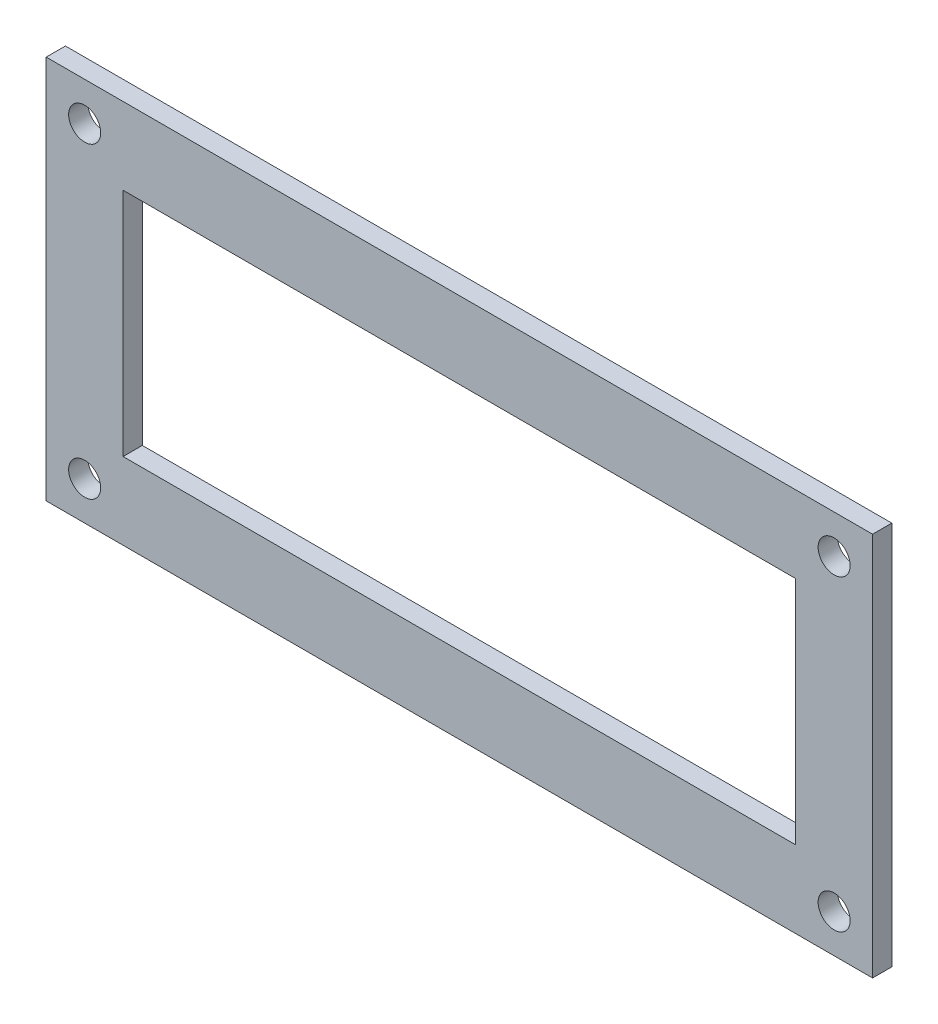
ISO-10303-21;
HEADER;
FILE_DESCRIPTION(('STEP AP214'),'2;1');
FILE_NAME('part.step','',(''),(''),'','','');
FILE_SCHEMA(('AUTOMOTIVE_DESIGN { 1 0 10303 214 1 1 1 1 }'));
ENDSEC;
DATA;
#1=APPLICATION_CONTEXT('core data for automotive mechanical design processes');
#2=APPLICATION_PROTOCOL_DEFINITION('international standard','automotive_design',2000,#1);
#3=PRODUCT_CONTEXT('',#1,'mechanical');
#4=PRODUCT('Part','Part','',(#3));
#5=PRODUCT_RELATED_PRODUCT_CATEGORY('part','',(#4));
#6=PRODUCT_DEFINITION_FORMATION('','',#4);
#7=PRODUCT_DEFINITION_CONTEXT('part definition',#1,'design');
#8=PRODUCT_DEFINITION('design','',#6,#7);
#9=PRODUCT_DEFINITION_SHAPE('','',#8);
#10=(LENGTH_UNIT() NAMED_UNIT(*) SI_UNIT(.MILLI.,.METRE.));
#11=(NAMED_UNIT(*) PLANE_ANGLE_UNIT() SI_UNIT($,.RADIAN.));
#12=(NAMED_UNIT(*) SI_UNIT($,.STERADIAN.) SOLID_ANGLE_UNIT());
#13=UNCERTAINTY_MEASURE_WITH_UNIT(LENGTH_MEASURE(1.E-05),#10,'distance_accuracy_value','');
#14=(GEOMETRIC_REPRESENTATION_CONTEXT(3) GLOBAL_UNCERTAINTY_ASSIGNED_CONTEXT((#13)) GLOBAL_UNIT_ASSIGNED_CONTEXT((#10,
#11,#12)) REPRESENTATION_CONTEXT('',''));
#15=CARTESIAN_POINT('',(0.,0.,0.));
#16=DIRECTION('',(0.,0.,1.));
#17=DIRECTION('',(1.,0.,0.));
#18=AXIS2_PLACEMENT_3D('',#15,#16,#17);
#19=CARTESIAN_POINT('',(0.,0.,3.));
#20=DIRECTION('',(0.,0.,-1.));
#21=DIRECTION('',(-1.,0.,0.));
#22=AXIS2_PLACEMENT_3D('',#19,#20,#21);
#23=PLANE('',#22);
#24=CARTESIAN_POINT('',(123.,6.,3.));
#25=DIRECTION('',(0.,0.,1.));
#26=DIRECTION('',(1.,0.,0.));
#27=AXIS2_PLACEMENT_3D('',#24,#25,#26);
#28=CIRCLE('',#27,2.5);
#29=CARTESIAN_POINT('',(125.5,6.,3.));
#30=VERTEX_POINT('',#29);
#31=EDGE_CURVE('E134',#30,#30,#28,.T.);
#32=ORIENTED_EDGE('',*,*,#31,.F.);
#33=EDGE_LOOP('',(#32));
#34=FACE_BOUND('',#33,.T.);
#35=CARTESIAN_POINT('',(6.,54.,3.));
#36=DIRECTION('',(0.,0.,1.));
#37=DIRECTION('',(1.,0.,0.));
#38=AXIS2_PLACEMENT_3D('',#35,#36,#37);
#39=CIRCLE('',#38,2.5);
#40=CARTESIAN_POINT('',(8.5,54.,3.));
#41=VERTEX_POINT('',#40);
#42=EDGE_CURVE('E146',#41,#41,#39,.T.);
#43=ORIENTED_EDGE('',*,*,#42,.F.);
#44=EDGE_LOOP('',(#43));
#45=FACE_BOUND('',#44,.T.);
#46=DIRECTION('',(0.,-1.,0.));
#47=VECTOR('',#46,1.);
#48=CARTESIAN_POINT('',(0.,0.,3.));
#49=LINE('',#48,#47);
#50=CARTESIAN_POINT('',(0.,60.,3.));
#51=VERTEX_POINT('',#50);
#52=CARTESIAN_POINT('',(0.,0.,3.));
#53=VERTEX_POINT('',#52);
#54=EDGE_CURVE('E158',#51,#53,#49,.T.);
#55=ORIENTED_EDGE('',*,*,#54,.T.);
#56=DIRECTION('',(1.,0.,0.));
#57=VECTOR('',#56,1.);
#58=CARTESIAN_POINT('',(0.,0.,3.));
#59=LINE('',#58,#57);
#60=CARTESIAN_POINT('',(129.,0.,3.));
#61=VERTEX_POINT('',#60);
#62=EDGE_CURVE('E161',#53,#61,#59,.T.);
#63=ORIENTED_EDGE('',*,*,#62,.T.);
#64=DIRECTION('',(0.,1.,0.));
#65=VECTOR('',#64,1.);
#66=CARTESIAN_POINT('',(129.,0.,3.));
#67=LINE('',#66,#65);
#68=CARTESIAN_POINT('',(129.,60.,3.));
#69=VERTEX_POINT('',#68);
#70=EDGE_CURVE('E164',#61,#69,#67,.T.);
#71=ORIENTED_EDGE('',*,*,#70,.T.);
#72=DIRECTION('',(-1.,0.,0.));
#73=VECTOR('',#72,1.);
#74=CARTESIAN_POINT('',(0.,60.,3.));
#75=LINE('',#74,#73);
#76=EDGE_CURVE('E166',#69,#51,#75,.T.);
#77=ORIENTED_EDGE('',*,*,#76,.T.);
#78=EDGE_LOOP('',(#55,#63,#71,#77));
#79=FACE_BOUND('',#78,.T.);
#80=CARTESIAN_POINT('',(6.,6.,3.));
#81=DIRECTION('',(0.,0.,1.));
#82=DIRECTION('',(1.,0.,0.));
#83=AXIS2_PLACEMENT_3D('',#80,#81,#82);
#84=CIRCLE('',#83,2.5);
#85=CARTESIAN_POINT('',(8.5,6.,3.));
#86=VERTEX_POINT('',#85);
#87=EDGE_CURVE('E152',#86,#86,#84,.T.);
#88=ORIENTED_EDGE('',*,*,#87,.F.);
#89=EDGE_LOOP('',(#88));
#90=FACE_BOUND('',#89,.T.);
#91=CARTESIAN_POINT('',(123.,54.,3.));
#92=DIRECTION('',(0.,0.,1.));
#93=DIRECTION('',(1.,0.,0.));
#94=AXIS2_PLACEMENT_3D('',#91,#92,#93);
#95=CIRCLE('',#94,2.5);
#96=CARTESIAN_POINT('',(125.5,54.,3.));
#97=VERTEX_POINT('',#96);
#98=EDGE_CURVE('E140',#97,#97,#95,.T.);
#99=ORIENTED_EDGE('',*,*,#98,.F.);
#100=EDGE_LOOP('',(#99));
#101=FACE_BOUND('',#100,.T.);
#102=DIRECTION('',(0.,-1.,0.));
#103=VECTOR('',#102,1.);
#104=CARTESIAN_POINT('',(12.,48.,3.));
#105=LINE('',#104,#103);
#106=CARTESIAN_POINT('',(12.,48.,3.));
#107=VERTEX_POINT('',#106);
#108=CARTESIAN_POINT('',(12.,12.,3.));
#109=VERTEX_POINT('',#108);
#110=EDGE_CURVE('E98',#107,#109,#105,.T.);
#111=ORIENTED_EDGE('',*,*,#110,.F.);
#112=DIRECTION('',(-1.,0.,0.));
#113=VECTOR('',#112,1.);
#114=CARTESIAN_POINT('',(12.,48.,3.));
#115=LINE('',#114,#113);
#116=CARTESIAN_POINT('',(117.,48.,3.));
#117=VERTEX_POINT('',#116);
#118=EDGE_CURVE('E120',#117,#107,#115,.T.);
#119=ORIENTED_EDGE('',*,*,#118,.F.);
#120=DIRECTION('',(0.,1.,0.));
#121=VECTOR('',#120,1.);
#122=CARTESIAN_POINT('',(117.,48.,3.));
#123=LINE('',#122,#121);
#124=CARTESIAN_POINT('',(117.,12.,3.));
#125=VERTEX_POINT('',#124);
#126=EDGE_CURVE('E118',#125,#117,#123,.T.);
#127=ORIENTED_EDGE('',*,*,#126,.F.);
#128=DIRECTION('',(1.,0.,0.));
#129=VECTOR('',#128,1.);
#130=CARTESIAN_POINT('',(12.,12.,3.));
#131=LINE('',#130,#129);
#132=EDGE_CURVE('E106',#109,#125,#131,.T.);
#133=ORIENTED_EDGE('',*,*,#132,.F.);
#134=EDGE_LOOP('',(#111,#119,#127,#133));
#135=FACE_BOUND('',#134,.T.);
#136=ADVANCED_FACE('F33',(#34,#45,#79,#90,#101,#135),#23,.F.);
#137=CARTESIAN_POINT('',(0.,0.,0.));
#138=DIRECTION('',(0.,0.,-1.));
#139=DIRECTION('',(-1.,0.,0.));
#140=AXIS2_PLACEMENT_3D('',#137,#138,#139);
#141=PLANE('',#140);
#142=CARTESIAN_POINT('',(123.,6.,0.));
#143=DIRECTION('',(0.,0.,1.));
#144=DIRECTION('',(1.,0.,0.));
#145=AXIS2_PLACEMENT_3D('',#142,#143,#144);
#146=CIRCLE('',#145,2.5);
#147=CARTESIAN_POINT('',(125.5,6.,0.));
#148=VERTEX_POINT('',#147);
#149=EDGE_CURVE('E114',#148,#148,#146,.T.);
#150=ORIENTED_EDGE('',*,*,#149,.T.);
#151=EDGE_LOOP('',(#150));
#152=FACE_BOUND('',#151,.T.);
#153=CARTESIAN_POINT('',(6.,54.,0.));
#154=DIRECTION('',(0.,0.,1.));
#155=DIRECTION('',(1.,0.,0.));
#156=AXIS2_PLACEMENT_3D('',#153,#154,#155);
#157=CIRCLE('',#156,2.5);
#158=CARTESIAN_POINT('',(8.5,54.,0.));
#159=VERTEX_POINT('',#158);
#160=EDGE_CURVE('E143',#159,#159,#157,.T.);
#161=ORIENTED_EDGE('',*,*,#160,.T.);
#162=EDGE_LOOP('',(#161));
#163=FACE_BOUND('',#162,.T.);
#164=DIRECTION('',(0.,-1.,0.));
#165=VECTOR('',#164,1.);
#166=CARTESIAN_POINT('',(0.,0.,0.));
#167=LINE('',#166,#165);
#168=CARTESIAN_POINT('',(0.,60.,0.));
#169=VERTEX_POINT('',#168);
#170=CARTESIAN_POINT('',(0.,0.,0.));
#171=VERTEX_POINT('',#170);
#172=EDGE_CURVE('E155',#169,#171,#167,.T.);
#173=ORIENTED_EDGE('',*,*,#172,.F.);
#174=DIRECTION('',(-1.,0.,0.));
#175=VECTOR('',#174,1.);
#176=CARTESIAN_POINT('',(0.,60.,0.));
#177=LINE('',#176,#175);
#178=CARTESIAN_POINT('',(129.,60.,0.));
#179=VERTEX_POINT('',#178);
#180=EDGE_CURVE('E162',#179,#169,#177,.T.);
#181=ORIENTED_EDGE('',*,*,#180,.F.);
#182=DIRECTION('',(0.,1.,0.));
#183=VECTOR('',#182,1.);
#184=CARTESIAN_POINT('',(129.,0.,0.));
#185=LINE('',#184,#183);
#186=CARTESIAN_POINT('',(129.,0.,0.));
#187=VERTEX_POINT('',#186);
#188=EDGE_CURVE('E173',#187,#179,#185,.T.);
#189=ORIENTED_EDGE('',*,*,#188,.F.);
#190=DIRECTION('',(1.,0.,0.));
#191=VECTOR('',#190,1.);
#192=CARTESIAN_POINT('',(0.,0.,0.));
#193=LINE('',#192,#191);
#194=EDGE_CURVE('E171',#171,#187,#193,.T.);
#195=ORIENTED_EDGE('',*,*,#194,.F.);
#196=EDGE_LOOP('',(#173,#181,#189,#195));
#197=FACE_BOUND('',#196,.T.);
#198=CARTESIAN_POINT('',(6.,6.,0.));
#199=DIRECTION('',(0.,0.,1.));
#200=DIRECTION('',(1.,0.,0.));
#201=AXIS2_PLACEMENT_3D('',#198,#199,#200);
#202=CIRCLE('',#201,2.5);
#203=CARTESIAN_POINT('',(8.5,6.,0.));
#204=VERTEX_POINT('',#203);
#205=EDGE_CURVE('E149',#204,#204,#202,.T.);
#206=ORIENTED_EDGE('',*,*,#205,.T.);
#207=EDGE_LOOP('',(#206));
#208=FACE_BOUND('',#207,.T.);
#209=CARTESIAN_POINT('',(123.,54.,0.));
#210=DIRECTION('',(0.,0.,1.));
#211=DIRECTION('',(1.,0.,0.));
#212=AXIS2_PLACEMENT_3D('',#209,#210,#211);
#213=CIRCLE('',#212,2.5);
#214=CARTESIAN_POINT('',(125.5,54.,0.));
#215=VERTEX_POINT('',#214);
#216=EDGE_CURVE('E137',#215,#215,#213,.T.);
#217=ORIENTED_EDGE('',*,*,#216,.T.);
#218=EDGE_LOOP('',(#217));
#219=FACE_BOUND('',#218,.T.);
#220=DIRECTION('',(-1.,0.,0.));
#221=VECTOR('',#220,1.);
#222=CARTESIAN_POINT('',(12.,48.,0.));
#223=LINE('',#222,#221);
#224=CARTESIAN_POINT('',(117.,48.,0.));
#225=VERTEX_POINT('',#224);
#226=CARTESIAN_POINT('',(12.,48.,0.));
#227=VERTEX_POINT('',#226);
#228=EDGE_CURVE('E107',#225,#227,#223,.T.);
#229=ORIENTED_EDGE('',*,*,#228,.T.);
#230=DIRECTION('',(0.,-1.,0.));
#231=VECTOR('',#230,1.);
#232=CARTESIAN_POINT('',(12.,48.,0.));
#233=LINE('',#232,#231);
#234=CARTESIAN_POINT('',(12.,12.,0.));
#235=VERTEX_POINT('',#234);
#236=EDGE_CURVE('E56',#227,#235,#233,.T.);
#237=ORIENTED_EDGE('',*,*,#236,.T.);
#238=DIRECTION('',(1.,0.,0.));
#239=VECTOR('',#238,1.);
#240=CARTESIAN_POINT('',(12.,12.,0.));
#241=LINE('',#240,#239);
#242=CARTESIAN_POINT('',(117.,12.,0.));
#243=VERTEX_POINT('',#242);
#244=EDGE_CURVE('E113',#235,#243,#241,.T.);
#245=ORIENTED_EDGE('',*,*,#244,.T.);
#246=DIRECTION('',(0.,1.,0.));
#247=VECTOR('',#246,1.);
#248=CARTESIAN_POINT('',(117.,48.,0.));
#249=LINE('',#248,#247);
#250=EDGE_CURVE('E126',#243,#225,#249,.T.);
#251=ORIENTED_EDGE('',*,*,#250,.T.);
#252=EDGE_LOOP('',(#229,#237,#245,#251));
#253=FACE_BOUND('',#252,.T.);
#254=ADVANCED_FACE('F191',(#152,#163,#197,#208,#219,#253),#141,.T.);
#255=CARTESIAN_POINT('',(0.,0.,3.));
#256=DIRECTION('',(1.,0.,0.));
#257=DIRECTION('',(0.,0.,-1.));
#258=AXIS2_PLACEMENT_3D('',#255,#256,#257);
#259=PLANE('',#258);
#260=ORIENTED_EDGE('',*,*,#172,.T.);
#261=DIRECTION('',(0.,0.,-1.));
#262=VECTOR('',#261,1.);
#263=CARTESIAN_POINT('',(0.,0.,3.));
#264=LINE('',#263,#262);
#265=EDGE_CURVE('E11',#53,#171,#264,.T.);
#266=ORIENTED_EDGE('',*,*,#265,.F.);
#267=ORIENTED_EDGE('',*,*,#54,.F.);
#268=DIRECTION('',(0.,0.,-1.));
#269=VECTOR('',#268,1.);
#270=CARTESIAN_POINT('',(0.,60.,3.));
#271=LINE('',#270,#269);
#272=EDGE_CURVE('E168',#51,#169,#271,.T.);
#273=ORIENTED_EDGE('',*,*,#272,.T.);
#274=EDGE_LOOP('',(#260,#266,#267,#273));
#275=FACE_BOUND('',#274,.T.);
#276=ADVANCED_FACE('F35',(#275),#259,.F.);
#277=CARTESIAN_POINT('',(0.,0.,3.));
#278=DIRECTION('',(0.,1.,0.));
#279=DIRECTION('',(0.,0.,1.));
#280=AXIS2_PLACEMENT_3D('',#277,#278,#279);
#281=PLANE('',#280);
#282=ORIENTED_EDGE('',*,*,#194,.T.);
#283=DIRECTION('',(0.,0.,-1.));
#284=VECTOR('',#283,1.);
#285=CARTESIAN_POINT('',(129.,0.,3.));
#286=LINE('',#285,#284);
#287=EDGE_CURVE('E41',#61,#187,#286,.T.);
#288=ORIENTED_EDGE('',*,*,#287,.F.);
#289=ORIENTED_EDGE('',*,*,#62,.F.);
#290=ORIENTED_EDGE('',*,*,#265,.T.);
#291=EDGE_LOOP('',(#282,#288,#289,#290));
#292=FACE_BOUND('',#291,.T.);
#293=ADVANCED_FACE('F202',(#292),#281,.F.);
#294=CARTESIAN_POINT('',(129.,0.,3.));
#295=DIRECTION('',(-1.,0.,0.));
#296=DIRECTION('',(0.,0.,1.));
#297=AXIS2_PLACEMENT_3D('',#294,#295,#296);
#298=PLANE('',#297);
#299=ORIENTED_EDGE('',*,*,#188,.T.);
#300=DIRECTION('',(0.,0.,-1.));
#301=VECTOR('',#300,1.);
#302=CARTESIAN_POINT('',(129.,60.,3.));
#303=LINE('',#302,#301);
#304=EDGE_CURVE('E178',#69,#179,#303,.T.);
#305=ORIENTED_EDGE('',*,*,#304,.F.);
#306=ORIENTED_EDGE('',*,*,#70,.F.);
#307=ORIENTED_EDGE('',*,*,#287,.T.);
#308=EDGE_LOOP('',(#299,#305,#306,#307));
#309=FACE_BOUND('',#308,.T.);
#310=ADVANCED_FACE('F185',(#309),#298,.F.);
#311=CARTESIAN_POINT('',(0.,60.,3.));
#312=DIRECTION('',(0.,-1.,0.));
#313=DIRECTION('',(0.,0.,-1.));
#314=AXIS2_PLACEMENT_3D('',#311,#312,#313);
#315=PLANE('',#314);
#316=ORIENTED_EDGE('',*,*,#180,.T.);
#317=ORIENTED_EDGE('',*,*,#272,.F.);
#318=ORIENTED_EDGE('',*,*,#76,.F.);
#319=ORIENTED_EDGE('',*,*,#304,.T.);
#320=EDGE_LOOP('',(#316,#317,#318,#319));
#321=FACE_BOUND('',#320,.T.);
#322=ADVANCED_FACE('F195',(#321),#315,.F.);
#323=CARTESIAN_POINT('',(6.,6.,3.));
#324=DIRECTION('',(0.,0.,-1.));
#325=DIRECTION('',(-1.,0.,0.));
#326=AXIS2_PLACEMENT_3D('',#323,#324,#325);
#327=CYLINDRICAL_SURFACE('',#326,2.5);
#328=ORIENTED_EDGE('',*,*,#87,.T.);
#329=EDGE_LOOP('',(#328));
#330=FACE_BOUND('',#329,.T.);
#331=ORIENTED_EDGE('',*,*,#205,.F.);
#332=EDGE_LOOP('',(#331));
#333=FACE_BOUND('',#332,.T.);
#334=ADVANCED_FACE('F220',(#330,#333),#327,.F.);
#335=CARTESIAN_POINT('',(6.,54.,3.));
#336=DIRECTION('',(0.,0.,-1.));
#337=DIRECTION('',(-1.,0.,0.));
#338=AXIS2_PLACEMENT_3D('',#335,#336,#337);
#339=CYLINDRICAL_SURFACE('',#338,2.5);
#340=ORIENTED_EDGE('',*,*,#42,.T.);
#341=EDGE_LOOP('',(#340));
#342=FACE_BOUND('',#341,.T.);
#343=ORIENTED_EDGE('',*,*,#160,.F.);
#344=EDGE_LOOP('',(#343));
#345=FACE_BOUND('',#344,.T.);
#346=ADVANCED_FACE('F227',(#342,#345),#339,.F.);
#347=CARTESIAN_POINT('',(123.,54.,3.));
#348=DIRECTION('',(0.,0.,-1.));
#349=DIRECTION('',(-1.,0.,0.));
#350=AXIS2_PLACEMENT_3D('',#347,#348,#349);
#351=CYLINDRICAL_SURFACE('',#350,2.5);
#352=ORIENTED_EDGE('',*,*,#98,.T.);
#353=EDGE_LOOP('',(#352));
#354=FACE_BOUND('',#353,.T.);
#355=ORIENTED_EDGE('',*,*,#216,.F.);
#356=EDGE_LOOP('',(#355));
#357=FACE_BOUND('',#356,.T.);
#358=ADVANCED_FACE('F232',(#354,#357),#351,.F.);
#359=CARTESIAN_POINT('',(123.,6.,3.));
#360=DIRECTION('',(0.,0.,-1.));
#361=DIRECTION('',(-1.,0.,0.));
#362=AXIS2_PLACEMENT_3D('',#359,#360,#361);
#363=CYLINDRICAL_SURFACE('',#362,2.5);
#364=ORIENTED_EDGE('',*,*,#31,.T.);
#365=EDGE_LOOP('',(#364));
#366=FACE_BOUND('',#365,.T.);
#367=ORIENTED_EDGE('',*,*,#149,.F.);
#368=EDGE_LOOP('',(#367));
#369=FACE_BOUND('',#368,.T.);
#370=ADVANCED_FACE('F255',(#366,#369),#363,.F.);
#371=CARTESIAN_POINT('',(12.,48.,3.));
#372=DIRECTION('',(1.,0.,0.));
#373=DIRECTION('',(0.,1.,0.));
#374=AXIS2_PLACEMENT_3D('',#371,#372,#373);
#375=PLANE('',#374);
#376=ORIENTED_EDGE('',*,*,#236,.F.);
#377=DIRECTION('',(0.,0.,-1.));
#378=VECTOR('',#377,1.);
#379=CARTESIAN_POINT('',(12.,48.,3.));
#380=LINE('',#379,#378);
#381=EDGE_CURVE('E102',#107,#227,#380,.T.);
#382=ORIENTED_EDGE('',*,*,#381,.F.);
#383=ORIENTED_EDGE('',*,*,#110,.T.);
#384=DIRECTION('',(0.,0.,-1.));
#385=VECTOR('',#384,1.);
#386=CARTESIAN_POINT('',(12.,12.,3.));
#387=LINE('',#386,#385);
#388=EDGE_CURVE('E101',#109,#235,#387,.T.);
#389=ORIENTED_EDGE('',*,*,#388,.T.);
#390=EDGE_LOOP('',(#376,#382,#383,#389));
#391=FACE_BOUND('',#390,.T.);
#392=ADVANCED_FACE('F100',(#391),#375,.T.);
#393=CARTESIAN_POINT('',(12.,12.,3.));
#394=DIRECTION('',(0.,1.,0.));
#395=DIRECTION('',(-1.,0.,0.));
#396=AXIS2_PLACEMENT_3D('',#393,#394,#395);
#397=PLANE('',#396);
#398=ORIENTED_EDGE('',*,*,#244,.F.);
#399=ORIENTED_EDGE('',*,*,#388,.F.);
#400=ORIENTED_EDGE('',*,*,#132,.T.);
#401=DIRECTION('',(0.,0.,-1.));
#402=VECTOR('',#401,1.);
#403=CARTESIAN_POINT('',(117.,12.,3.));
#404=LINE('',#403,#402);
#405=EDGE_CURVE('E115',#125,#243,#404,.T.);
#406=ORIENTED_EDGE('',*,*,#405,.T.);
#407=EDGE_LOOP('',(#398,#399,#400,#406));
#408=FACE_BOUND('',#407,.T.);
#409=ADVANCED_FACE('F110',(#408),#397,.T.);
#410=CARTESIAN_POINT('',(117.,48.,3.));
#411=DIRECTION('',(-1.,0.,0.));
#412=DIRECTION('',(0.,0.,1.));
#413=AXIS2_PLACEMENT_3D('',#410,#411,#412);
#414=PLANE('',#413);
#415=ORIENTED_EDGE('',*,*,#250,.F.);
#416=ORIENTED_EDGE('',*,*,#405,.F.);
#417=ORIENTED_EDGE('',*,*,#126,.T.);
#418=DIRECTION('',(0.,0.,-1.));
#419=VECTOR('',#418,1.);
#420=CARTESIAN_POINT('',(117.,48.,3.));
#421=LINE('',#420,#419);
#422=EDGE_CURVE('E48',#117,#225,#421,.T.);
#423=ORIENTED_EDGE('',*,*,#422,.T.);
#424=EDGE_LOOP('',(#415,#416,#417,#423));
#425=FACE_BOUND('',#424,.T.);
#426=ADVANCED_FACE('F243',(#425),#414,.T.);
#427=CARTESIAN_POINT('',(12.,48.,3.));
#428=DIRECTION('',(0.,-1.,0.));
#429=DIRECTION('',(0.,0.,-1.));
#430=AXIS2_PLACEMENT_3D('',#427,#428,#429);
#431=PLANE('',#430);
#432=ORIENTED_EDGE('',*,*,#228,.F.);
#433=ORIENTED_EDGE('',*,*,#422,.F.);
#434=ORIENTED_EDGE('',*,*,#118,.T.);
#435=ORIENTED_EDGE('',*,*,#381,.T.);
#436=EDGE_LOOP('',(#432,#433,#434,#435));
#437=FACE_BOUND('',#436,.T.);
#438=ADVANCED_FACE('F241',(#437),#431,.T.);
#439=CLOSED_SHELL('',(#136,#254,#276,#293,#310,#322,#334,#346,#358,#370,#392,#409,#426,#438));
#440=MANIFOLD_SOLID_BREP('B2',#439);
#441=ADVANCED_BREP_SHAPE_REPRESENTATION('',(#18,#440),#14);
#442=SHAPE_DEFINITION_REPRESENTATION(#9,#441);
ENDSEC;
END-ISO-10303-21;
